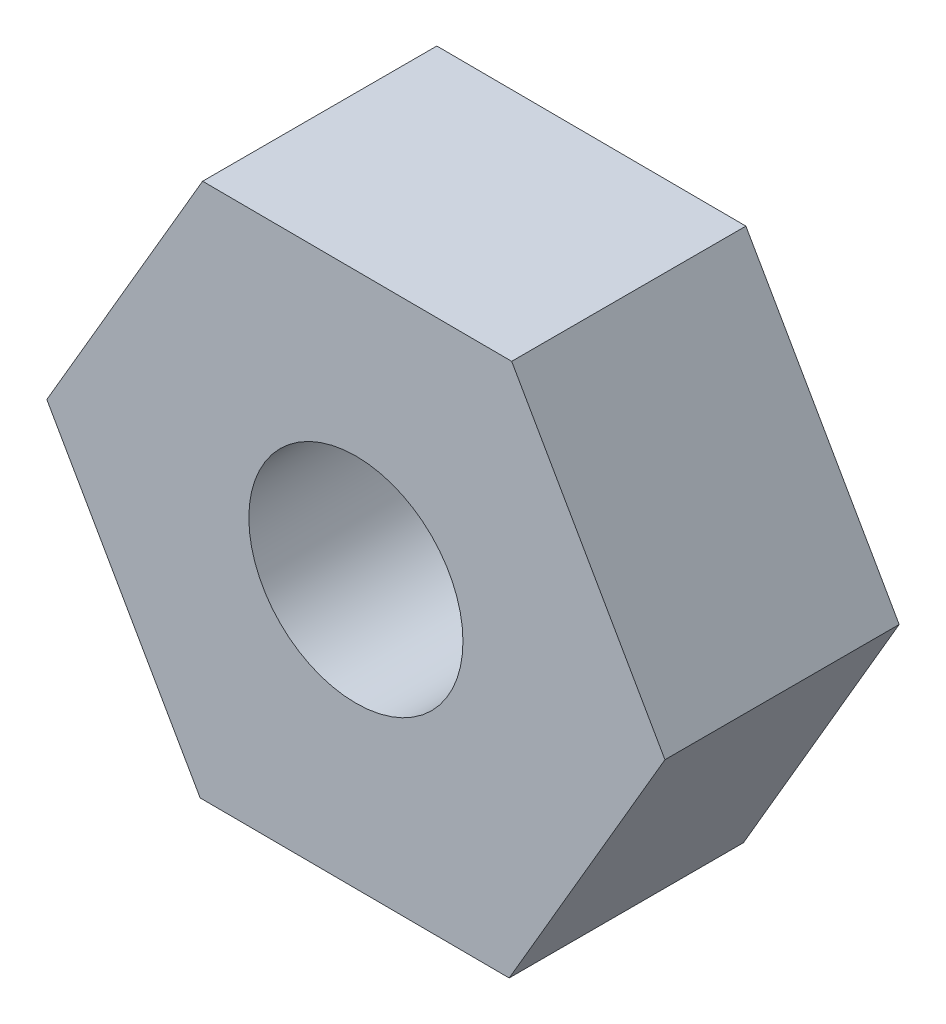
ISO-10303-21;
HEADER;
FILE_DESCRIPTION(('STEP AP214'),'2;1');
FILE_NAME('part.step','',(''),(''),'','','');
FILE_SCHEMA(('AUTOMOTIVE_DESIGN { 1 0 10303 214 1 1 1 1 }'));
ENDSEC;
DATA;
#1=APPLICATION_CONTEXT('core data for automotive mechanical design processes');
#2=APPLICATION_PROTOCOL_DEFINITION('international standard','automotive_design',2000,#1);
#3=PRODUCT_CONTEXT('',#1,'mechanical');
#4=PRODUCT('Part','Part','',(#3));
#5=PRODUCT_RELATED_PRODUCT_CATEGORY('part','',(#4));
#6=PRODUCT_DEFINITION_FORMATION('','',#4);
#7=PRODUCT_DEFINITION_CONTEXT('part definition',#1,'design');
#8=PRODUCT_DEFINITION('design','',#6,#7);
#9=PRODUCT_DEFINITION_SHAPE('','',#8);
#10=(LENGTH_UNIT() NAMED_UNIT(*) SI_UNIT(.MILLI.,.METRE.));
#11=(NAMED_UNIT(*) PLANE_ANGLE_UNIT() SI_UNIT($,.RADIAN.));
#12=(NAMED_UNIT(*) SI_UNIT($,.STERADIAN.) SOLID_ANGLE_UNIT());
#13=UNCERTAINTY_MEASURE_WITH_UNIT(LENGTH_MEASURE(1.E-05),#10,'distance_accuracy_value','');
#14=(GEOMETRIC_REPRESENTATION_CONTEXT(3) GLOBAL_UNCERTAINTY_ASSIGNED_CONTEXT((#13)) GLOBAL_UNIT_ASSIGNED_CONTEXT((#10,
#11,#12)) REPRESENTATION_CONTEXT('',''));
#15=CARTESIAN_POINT('',(0.,0.,0.));
#16=DIRECTION('',(0.,0.,1.));
#17=DIRECTION('',(1.,0.,0.));
#18=AXIS2_PLACEMENT_3D('',#15,#16,#17);
#19=CARTESIAN_POINT('',(0.,0.,3.5));
#20=DIRECTION('',(0.,0.,1.));
#21=DIRECTION('',(1.,0.,0.));
#22=AXIS2_PLACEMENT_3D('',#19,#20,#21);
#23=PLANE('',#22);
#24=DIRECTION('',(-0.999989108419823,0.0046672306272132,0.));
#25=VECTOR('',#24,1.);
#26=CARTESIAN_POINT('',(2.32804484624037,3.98917792624333,3.5));
#27=LINE('',#26,#25);
#28=CARTESIAN_POINT('',(2.32804484624037,3.98917792624333,3.5));
#29=VERTEX_POINT('',#28);
#30=CARTESIAN_POINT('',(-2.29070700122266,4.01073494111526,3.5));
#31=VERTEX_POINT('',#30);
#32=EDGE_CURVE('E130',#29,#31,#27,.T.);
#33=ORIENTED_EDGE('',*,*,#32,.T.);
#34=DIRECTION('',(-0.504036494498399,-0.863682356085711,0.));
#35=VECTOR('',#34,1.);
#36=CARTESIAN_POINT('',(-2.29070700122266,4.01073494111526,3.5));
#37=LINE('',#36,#35);
#38=CARTESIAN_POINT('',(-4.61875184746303,0.0215570148719339,3.5));
#39=VERTEX_POINT('',#38);
#40=EDGE_CURVE('E88',#31,#39,#37,.T.);
#41=ORIENTED_EDGE('',*,*,#40,.T.);
#42=DIRECTION('',(0.495952613921424,-0.868349586712925,0.));
#43=VECTOR('',#42,1.);
#44=CARTESIAN_POINT('',(-4.61875184746303,0.0215570148719339,3.5));
#45=LINE('',#44,#43);
#46=CARTESIAN_POINT('',(-2.32804484624037,-3.98917792624332,3.5));
#47=VERTEX_POINT('',#46);
#48=EDGE_CURVE('E101',#39,#47,#45,.T.);
#49=ORIENTED_EDGE('',*,*,#48,.T.);
#50=DIRECTION('',(0.999989108419823,-0.0046672306272132,0.));
#51=VECTOR('',#50,1.);
#52=CARTESIAN_POINT('',(-2.32804484624037,-3.98917792624332,3.5));
#53=LINE('',#52,#51);
#54=CARTESIAN_POINT('',(2.29070700122267,-4.01073494111526,3.5));
#55=VERTEX_POINT('',#54);
#56=EDGE_CURVE('E95',#47,#55,#53,.T.);
#57=ORIENTED_EDGE('',*,*,#56,.T.);
#58=DIRECTION('',(0.504036494498399,0.863682356085711,0.));
#59=VECTOR('',#58,1.);
#60=CARTESIAN_POINT('',(2.29070700122267,-4.01073494111526,3.5));
#61=LINE('',#60,#59);
#62=CARTESIAN_POINT('',(4.61875184746303,-0.0215570148719346,3.5));
#63=VERTEX_POINT('',#62);
#64=EDGE_CURVE('E99',#55,#63,#61,.T.);
#65=ORIENTED_EDGE('',*,*,#64,.T.);
#66=DIRECTION('',(-0.495952613921424,0.868349586712925,0.));
#67=VECTOR('',#66,1.);
#68=CARTESIAN_POINT('',(4.61875184746303,-0.0215570148719346,3.5));
#69=LINE('',#68,#67);
#70=EDGE_CURVE('E51',#63,#29,#69,.T.);
#71=ORIENTED_EDGE('',*,*,#70,.T.);
#72=EDGE_LOOP('',(#33,#41,#49,#57,#65,#71));
#73=FACE_BOUND('',#72,.T.);
#74=CARTESIAN_POINT('',(0.,0.,3.5));
#75=DIRECTION('',(0.,0.,1.));
#76=DIRECTION('',(1.,0.,0.));
#77=AXIS2_PLACEMENT_3D('',#74,#75,#76);
#78=CIRCLE('',#77,1.6);
#79=CARTESIAN_POINT('',(1.6,0.,3.5));
#80=VERTEX_POINT('',#79);
#81=EDGE_CURVE('E123',#80,#80,#78,.T.);
#82=ORIENTED_EDGE('',*,*,#81,.F.);
#83=EDGE_LOOP('',(#82));
#84=FACE_BOUND('',#83,.T.);
#85=ADVANCED_FACE('F34',(#73,#84),#23,.T.);
#86=CARTESIAN_POINT('',(0.,0.,0.));
#87=DIRECTION('',(0.,0.,1.));
#88=DIRECTION('',(1.,0.,0.));
#89=AXIS2_PLACEMENT_3D('',#86,#87,#88);
#90=PLANE('',#89);
#91=DIRECTION('',(-0.999989108419823,0.0046672306272132,0.));
#92=VECTOR('',#91,1.);
#93=CARTESIAN_POINT('',(2.32804484624037,3.98917792624333,0.));
#94=LINE('',#93,#92);
#95=CARTESIAN_POINT('',(2.32804484624037,3.98917792624333,0.));
#96=VERTEX_POINT('',#95);
#97=CARTESIAN_POINT('',(-2.29070700122266,4.01073494111526,0.));
#98=VERTEX_POINT('',#97);
#99=EDGE_CURVE('E119',#96,#98,#94,.T.);
#100=ORIENTED_EDGE('',*,*,#99,.F.);
#101=DIRECTION('',(-0.495952613921424,0.868349586712925,0.));
#102=VECTOR('',#101,1.);
#103=CARTESIAN_POINT('',(4.61875184746303,-0.0215570148719346,0.));
#104=LINE('',#103,#102);
#105=CARTESIAN_POINT('',(4.61875184746303,-0.0215570148719346,0.));
#106=VERTEX_POINT('',#105);
#107=EDGE_CURVE('E80',#106,#96,#104,.T.);
#108=ORIENTED_EDGE('',*,*,#107,.F.);
#109=DIRECTION('',(0.504036494498399,0.863682356085711,0.));
#110=VECTOR('',#109,1.);
#111=CARTESIAN_POINT('',(2.29070700122267,-4.01073494111526,0.));
#112=LINE('',#111,#110);
#113=CARTESIAN_POINT('',(2.29070700122267,-4.01073494111526,0.));
#114=VERTEX_POINT('',#113);
#115=EDGE_CURVE('E74',#114,#106,#112,.T.);
#116=ORIENTED_EDGE('',*,*,#115,.F.);
#117=DIRECTION('',(0.999989108419823,-0.0046672306272132,0.));
#118=VECTOR('',#117,1.);
#119=CARTESIAN_POINT('',(-2.32804484624037,-3.98917792624332,0.));
#120=LINE('',#119,#118);
#121=CARTESIAN_POINT('',(-2.32804484624037,-3.98917792624332,0.));
#122=VERTEX_POINT('',#121);
#123=EDGE_CURVE('E109',#122,#114,#120,.T.);
#124=ORIENTED_EDGE('',*,*,#123,.F.);
#125=DIRECTION('',(0.495952613921424,-0.868349586712925,0.));
#126=VECTOR('',#125,1.);
#127=CARTESIAN_POINT('',(-4.61875184746303,0.0215570148719339,0.));
#128=LINE('',#127,#126);
#129=CARTESIAN_POINT('',(-4.61875184746303,0.0215570148719339,0.));
#130=VERTEX_POINT('',#129);
#131=EDGE_CURVE('E125',#130,#122,#128,.T.);
#132=ORIENTED_EDGE('',*,*,#131,.F.);
#133=DIRECTION('',(-0.504036494498399,-0.863682356085711,0.));
#134=VECTOR('',#133,1.);
#135=CARTESIAN_POINT('',(-2.29070700122266,4.01073494111526,0.));
#136=LINE('',#135,#134);
#137=EDGE_CURVE('E122',#98,#130,#136,.T.);
#138=ORIENTED_EDGE('',*,*,#137,.F.);
#139=EDGE_LOOP('',(#100,#108,#116,#124,#132,#138));
#140=FACE_BOUND('',#139,.T.);
#141=CARTESIAN_POINT('',(0.,0.,0.));
#142=DIRECTION('',(0.,0.,1.));
#143=DIRECTION('',(1.,0.,0.));
#144=AXIS2_PLACEMENT_3D('',#141,#142,#143);
#145=CIRCLE('',#144,1.6);
#146=CARTESIAN_POINT('',(1.6,0.,0.));
#147=VERTEX_POINT('',#146);
#148=EDGE_CURVE('E223',#147,#147,#145,.T.);
#149=ORIENTED_EDGE('',*,*,#148,.T.);
#150=EDGE_LOOP('',(#149));
#151=FACE_BOUND('',#150,.T.);
#152=ADVANCED_FACE('F139',(#140,#151),#90,.F.);
#153=CARTESIAN_POINT('',(2.32804484624037,3.98917792624333,3.5));
#154=DIRECTION('',(-0.0046672306272132,-0.999989108419823,0.));
#155=DIRECTION('',(0.999989108419823,-0.0046672306272132,0.));
#156=AXIS2_PLACEMENT_3D('',#153,#154,#155);
#157=PLANE('',#156);
#158=ORIENTED_EDGE('',*,*,#99,.T.);
#159=DIRECTION('',(0.,0.,-1.));
#160=VECTOR('',#159,1.);
#161=CARTESIAN_POINT('',(-2.29070700122266,4.01073494111526,3.5));
#162=LINE('',#161,#160);
#163=EDGE_CURVE('E11',#31,#98,#162,.T.);
#164=ORIENTED_EDGE('',*,*,#163,.F.);
#165=ORIENTED_EDGE('',*,*,#32,.F.);
#166=DIRECTION('',(0.,0.,-1.));
#167=VECTOR('',#166,1.);
#168=CARTESIAN_POINT('',(2.32804484624037,3.98917792624333,3.5));
#169=LINE('',#168,#167);
#170=EDGE_CURVE('E115',#29,#96,#169,.T.);
#171=ORIENTED_EDGE('',*,*,#170,.T.);
#172=EDGE_LOOP('',(#158,#164,#165,#171));
#173=FACE_BOUND('',#172,.T.);
#174=ADVANCED_FACE('F36',(#173),#157,.F.);
#175=CARTESIAN_POINT('',(-2.29070700122266,4.01073494111526,3.5));
#176=DIRECTION('',(0.863682356085711,-0.504036494498399,0.));
#177=DIRECTION('',(0.504036494498399,0.863682356085711,0.));
#178=AXIS2_PLACEMENT_3D('',#175,#176,#177);
#179=PLANE('',#178);
#180=ORIENTED_EDGE('',*,*,#137,.T.);
#181=DIRECTION('',(0.,0.,-1.));
#182=VECTOR('',#181,1.);
#183=CARTESIAN_POINT('',(-4.61875184746303,0.0215570148719339,3.5));
#184=LINE('',#183,#182);
#185=EDGE_CURVE('E43',#39,#130,#184,.T.);
#186=ORIENTED_EDGE('',*,*,#185,.F.);
#187=ORIENTED_EDGE('',*,*,#40,.F.);
#188=ORIENTED_EDGE('',*,*,#163,.T.);
#189=EDGE_LOOP('',(#180,#186,#187,#188));
#190=FACE_BOUND('',#189,.T.);
#191=ADVANCED_FACE('F164',(#190),#179,.F.);
#192=CARTESIAN_POINT('',(-4.61875184746303,0.0215570148719339,3.5));
#193=DIRECTION('',(0.868349586712924,0.495952613921424,0.));
#194=DIRECTION('',(-0.495952613921424,0.868349586712925,0.));
#195=AXIS2_PLACEMENT_3D('',#192,#193,#194);
#196=PLANE('',#195);
#197=ORIENTED_EDGE('',*,*,#131,.T.);
#198=DIRECTION('',(0.,0.,-1.));
#199=VECTOR('',#198,1.);
#200=CARTESIAN_POINT('',(-2.32804484624037,-3.98917792624332,3.5));
#201=LINE('',#200,#199);
#202=EDGE_CURVE('E110',#47,#122,#201,.T.);
#203=ORIENTED_EDGE('',*,*,#202,.F.);
#204=ORIENTED_EDGE('',*,*,#48,.F.);
#205=ORIENTED_EDGE('',*,*,#185,.T.);
#206=EDGE_LOOP('',(#197,#203,#204,#205));
#207=FACE_BOUND('',#206,.T.);
#208=ADVANCED_FACE('F136',(#207),#196,.F.);
#209=CARTESIAN_POINT('',(-2.32804484624037,-3.98917792624332,3.5));
#210=DIRECTION('',(0.0046672306272132,0.999989108419823,0.));
#211=DIRECTION('',(-0.999989108419823,0.0046672306272132,0.));
#212=AXIS2_PLACEMENT_3D('',#209,#210,#211);
#213=PLANE('',#212);
#214=ORIENTED_EDGE('',*,*,#123,.T.);
#215=DIRECTION('',(0.,0.,-1.));
#216=VECTOR('',#215,1.);
#217=CARTESIAN_POINT('',(2.29070700122267,-4.01073494111526,3.5));
#218=LINE('',#217,#216);
#219=EDGE_CURVE('E106',#55,#114,#218,.T.);
#220=ORIENTED_EDGE('',*,*,#219,.F.);
#221=ORIENTED_EDGE('',*,*,#56,.F.);
#222=ORIENTED_EDGE('',*,*,#202,.T.);
#223=EDGE_LOOP('',(#214,#220,#221,#222));
#224=FACE_BOUND('',#223,.T.);
#225=ADVANCED_FACE('F107',(#224),#213,.F.);
#226=CARTESIAN_POINT('',(2.29070700122267,-4.01073494111526,3.5));
#227=DIRECTION('',(-0.863682356085711,0.504036494498399,0.));
#228=DIRECTION('',(-0.504036494498399,-0.863682356085711,0.));
#229=AXIS2_PLACEMENT_3D('',#226,#227,#228);
#230=PLANE('',#229);
#231=ORIENTED_EDGE('',*,*,#115,.T.);
#232=DIRECTION('',(0.,0.,-1.));
#233=VECTOR('',#232,1.);
#234=CARTESIAN_POINT('',(4.61875184746303,-0.0215570148719346,3.5));
#235=LINE('',#234,#233);
#236=EDGE_CURVE('E111',#63,#106,#235,.T.);
#237=ORIENTED_EDGE('',*,*,#236,.F.);
#238=ORIENTED_EDGE('',*,*,#64,.F.);
#239=ORIENTED_EDGE('',*,*,#219,.T.);
#240=EDGE_LOOP('',(#231,#237,#238,#239));
#241=FACE_BOUND('',#240,.T.);
#242=ADVANCED_FACE('F113',(#241),#230,.F.);
#243=CARTESIAN_POINT('',(4.61875184746303,-0.0215570148719346,3.5));
#244=DIRECTION('',(-0.868349586712925,-0.495952613921424,0.));
#245=DIRECTION('',(0.495952613921424,-0.868349586712925,0.));
#246=AXIS2_PLACEMENT_3D('',#243,#244,#245);
#247=PLANE('',#246);
#248=ORIENTED_EDGE('',*,*,#107,.T.);
#249=ORIENTED_EDGE('',*,*,#170,.F.);
#250=ORIENTED_EDGE('',*,*,#70,.F.);
#251=ORIENTED_EDGE('',*,*,#236,.T.);
#252=EDGE_LOOP('',(#248,#249,#250,#251));
#253=FACE_BOUND('',#252,.T.);
#254=ADVANCED_FACE('F144',(#253),#247,.F.);
#255=CARTESIAN_POINT('',(0.,0.,3.5));
#256=DIRECTION('',(0.,0.,-1.));
#257=DIRECTION('',(-1.,0.,0.));
#258=AXIS2_PLACEMENT_3D('',#255,#256,#257);
#259=CYLINDRICAL_SURFACE('',#258,1.6);
#260=ORIENTED_EDGE('',*,*,#81,.T.);
#261=EDGE_LOOP('',(#260));
#262=FACE_BOUND('',#261,.T.);
#263=ORIENTED_EDGE('',*,*,#148,.F.);
#264=EDGE_LOOP('',(#263));
#265=FACE_BOUND('',#264,.T.);
#266=ADVANCED_FACE('F146',(#262,#265),#259,.F.);
#267=CLOSED_SHELL('',(#85,#152,#174,#191,#208,#225,#242,#254,#266));
#268=MANIFOLD_SOLID_BREP('B2',#267);
#269=ADVANCED_BREP_SHAPE_REPRESENTATION('',(#18,#268),#14);
#270=SHAPE_DEFINITION_REPRESENTATION(#9,#269);
ENDSEC;
END-ISO-10303-21;
